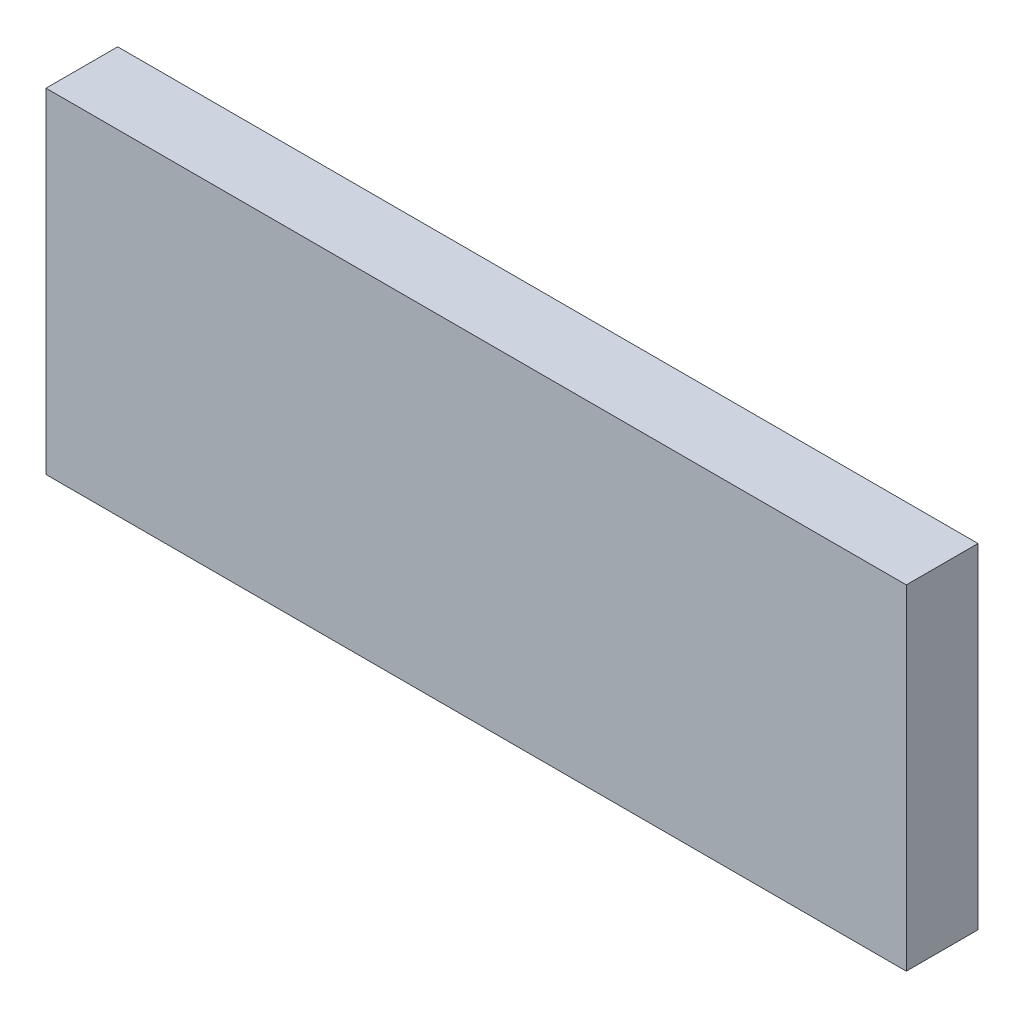
ISO-10303-21;
HEADER;
FILE_DESCRIPTION(('STEP AP214'),'2;1');
FILE_NAME('part.step','',(''),(''),'','','');
FILE_SCHEMA(('AUTOMOTIVE_DESIGN { 1 0 10303 214 1 1 1 1 }'));
ENDSEC;
DATA;
#1=APPLICATION_CONTEXT('core data for automotive mechanical design processes');
#2=APPLICATION_PROTOCOL_DEFINITION('international standard','automotive_design',2000,#1);
#3=PRODUCT_CONTEXT('',#1,'mechanical');
#4=PRODUCT('Part','Part','',(#3));
#5=PRODUCT_RELATED_PRODUCT_CATEGORY('part','',(#4));
#6=PRODUCT_DEFINITION_FORMATION('','',#4);
#7=PRODUCT_DEFINITION_CONTEXT('part definition',#1,'design');
#8=PRODUCT_DEFINITION('design','',#6,#7);
#9=PRODUCT_DEFINITION_SHAPE('','',#8);
#10=(LENGTH_UNIT() NAMED_UNIT(*) SI_UNIT(.MILLI.,.METRE.));
#11=(NAMED_UNIT(*) PLANE_ANGLE_UNIT() SI_UNIT($,.RADIAN.));
#12=(NAMED_UNIT(*) SI_UNIT($,.STERADIAN.) SOLID_ANGLE_UNIT());
#13=UNCERTAINTY_MEASURE_WITH_UNIT(LENGTH_MEASURE(1.E-05),#10,'distance_accuracy_value','');
#14=(GEOMETRIC_REPRESENTATION_CONTEXT(3) GLOBAL_UNCERTAINTY_ASSIGNED_CONTEXT((#13)) GLOBAL_UNIT_ASSIGNED_CONTEXT((#10,
#11,#12)) REPRESENTATION_CONTEXT('',''));
#15=CARTESIAN_POINT('',(0.,0.,0.));
#16=DIRECTION('',(0.,0.,1.));
#17=DIRECTION('',(1.,0.,0.));
#18=AXIS2_PLACEMENT_3D('',#15,#16,#17);
#19=CARTESIAN_POINT('',(0.,0.,0.15));
#20=DIRECTION('',(0.,0.,-1.));
#21=DIRECTION('',(-1.,0.,0.));
#22=AXIS2_PLACEMENT_3D('',#19,#20,#21);
#23=PLANE('',#22);
#24=DIRECTION('',(1.,0.,0.));
#25=VECTOR('',#24,1.);
#26=CARTESIAN_POINT('',(1.95,1.85,0.15));
#27=LINE('',#26,#25);
#28=CARTESIAN_POINT('',(1.95,1.85,0.15));
#29=VERTEX_POINT('',#28);
#30=CARTESIAN_POINT('',(3.75,1.85,0.15));
#31=VERTEX_POINT('',#30);
#32=EDGE_CURVE('E79',#29,#31,#27,.T.);
#33=ORIENTED_EDGE('',*,*,#32,.F.);
#34=DIRECTION('',(0.,1.,0.));
#35=VECTOR('',#34,1.);
#36=CARTESIAN_POINT('',(1.95,1.15,0.15));
#37=LINE('',#36,#35);
#38=CARTESIAN_POINT('',(1.95,1.15,0.15));
#39=VERTEX_POINT('',#38);
#40=EDGE_CURVE('E67',#39,#29,#37,.T.);
#41=ORIENTED_EDGE('',*,*,#40,.F.);
#42=DIRECTION('',(1.,0.,0.));
#43=VECTOR('',#42,1.);
#44=CARTESIAN_POINT('',(3.75,1.15,0.15));
#45=LINE('',#44,#43);
#46=CARTESIAN_POINT('',(3.75,1.15,0.15));
#47=VERTEX_POINT('',#46);
#48=EDGE_CURVE('E54',#47,#39,#45,.F.);
#49=ORIENTED_EDGE('',*,*,#48,.F.);
#50=DIRECTION('',(0.,1.,0.));
#51=VECTOR('',#50,1.);
#52=CARTESIAN_POINT('',(3.75,1.85,0.15));
#53=LINE('',#52,#51);
#54=EDGE_CURVE('E19',#31,#47,#53,.F.);
#55=ORIENTED_EDGE('',*,*,#54,.F.);
#56=EDGE_LOOP('',(#33,#41,#49,#55));
#57=FACE_BOUND('',#56,.T.);
#58=ADVANCED_FACE('F16',(#57),#23,.F.);
#59=CARTESIAN_POINT('',(3.75,1.85,0.15));
#60=DIRECTION('',(1.,0.,0.));
#61=DIRECTION('',(0.,1.,0.));
#62=AXIS2_PLACEMENT_3D('',#59,#60,#61);
#63=PLANE('',#62);
#64=ORIENTED_EDGE('',*,*,#54,.T.);
#65=DIRECTION('',(0.,0.,1.));
#66=VECTOR('',#65,1.);
#67=CARTESIAN_POINT('',(3.75,1.15,0.15));
#68=LINE('',#67,#66);
#69=CARTESIAN_POINT('',(3.75,1.15,0.));
#70=VERTEX_POINT('',#69);
#71=EDGE_CURVE('E60',#70,#47,#68,.T.);
#72=ORIENTED_EDGE('',*,*,#71,.F.);
#73=DIRECTION('',(0.,1.,0.));
#74=VECTOR('',#73,1.);
#75=CARTESIAN_POINT('',(3.75,0.,0.));
#76=LINE('',#75,#74);
#77=CARTESIAN_POINT('',(3.75,1.85,0.));
#78=VERTEX_POINT('',#77);
#79=EDGE_CURVE('E82',#78,#70,#76,.F.);
#80=ORIENTED_EDGE('',*,*,#79,.F.);
#81=DIRECTION('',(0.,0.,1.));
#82=VECTOR('',#81,1.);
#83=CARTESIAN_POINT('',(3.75,1.85,0.15));
#84=LINE('',#83,#82);
#85=EDGE_CURVE('E63',#31,#78,#84,.F.);
#86=ORIENTED_EDGE('',*,*,#85,.F.);
#87=EDGE_LOOP('',(#64,#72,#80,#86));
#88=FACE_BOUND('',#87,.T.);
#89=ADVANCED_FACE('F59',(#88),#63,.T.);
#90=CARTESIAN_POINT('',(3.75,1.15,0.15));
#91=DIRECTION('',(0.,-1.,0.));
#92=DIRECTION('',(1.,0.,0.));
#93=AXIS2_PLACEMENT_3D('',#90,#91,#92);
#94=PLANE('',#93);
#95=ORIENTED_EDGE('',*,*,#48,.T.);
#96=DIRECTION('',(0.,0.,1.));
#97=VECTOR('',#96,1.);
#98=CARTESIAN_POINT('',(1.95,1.15,0.15));
#99=LINE('',#98,#97);
#100=CARTESIAN_POINT('',(1.95,1.15,0.));
#101=VERTEX_POINT('',#100);
#102=EDGE_CURVE('E69',#101,#39,#99,.T.);
#103=ORIENTED_EDGE('',*,*,#102,.F.);
#104=DIRECTION('',(-1.,0.,0.));
#105=VECTOR('',#104,1.);
#106=CARTESIAN_POINT('',(0.,1.15,0.));
#107=LINE('',#106,#105);
#108=EDGE_CURVE('E73',#70,#101,#107,.T.);
#109=ORIENTED_EDGE('',*,*,#108,.F.);
#110=ORIENTED_EDGE('',*,*,#71,.T.);
#111=EDGE_LOOP('',(#95,#103,#109,#110));
#112=FACE_BOUND('',#111,.T.);
#113=ADVANCED_FACE('F71',(#112),#94,.T.);
#114=CARTESIAN_POINT('',(1.95,1.15,0.15));
#115=DIRECTION('',(-1.,0.,0.));
#116=DIRECTION('',(0.,0.,1.));
#117=AXIS2_PLACEMENT_3D('',#114,#115,#116);
#118=PLANE('',#117);
#119=ORIENTED_EDGE('',*,*,#40,.T.);
#120=DIRECTION('',(0.,0.,1.));
#121=VECTOR('',#120,1.);
#122=CARTESIAN_POINT('',(1.95,1.85,0.15));
#123=LINE('',#122,#121);
#124=CARTESIAN_POINT('',(1.95,1.85,0.));
#125=VERTEX_POINT('',#124);
#126=EDGE_CURVE('E34',#125,#29,#123,.T.);
#127=ORIENTED_EDGE('',*,*,#126,.F.);
#128=DIRECTION('',(0.,1.,0.));
#129=VECTOR('',#128,1.);
#130=CARTESIAN_POINT('',(1.95,0.,0.));
#131=LINE('',#130,#129);
#132=EDGE_CURVE('E25',#101,#125,#131,.T.);
#133=ORIENTED_EDGE('',*,*,#132,.F.);
#134=ORIENTED_EDGE('',*,*,#102,.T.);
#135=EDGE_LOOP('',(#119,#127,#133,#134));
#136=FACE_BOUND('',#135,.T.);
#137=ADVANCED_FACE('F88',(#136),#118,.T.);
#138=CARTESIAN_POINT('',(1.95,1.85,0.15));
#139=DIRECTION('',(0.,1.,0.));
#140=DIRECTION('',(0.,0.,1.));
#141=AXIS2_PLACEMENT_3D('',#138,#139,#140);
#142=PLANE('',#141);
#143=ORIENTED_EDGE('',*,*,#32,.T.);
#144=ORIENTED_EDGE('',*,*,#85,.T.);
#145=DIRECTION('',(-1.,0.,0.));
#146=VECTOR('',#145,1.);
#147=CARTESIAN_POINT('',(0.,1.85,0.));
#148=LINE('',#147,#146);
#149=EDGE_CURVE('E11',#125,#78,#148,.F.);
#150=ORIENTED_EDGE('',*,*,#149,.F.);
#151=ORIENTED_EDGE('',*,*,#126,.T.);
#152=EDGE_LOOP('',(#143,#144,#150,#151));
#153=FACE_BOUND('',#152,.T.);
#154=ADVANCED_FACE('F90',(#153),#142,.T.);
#155=CARTESIAN_POINT('',(0.,0.,0.));
#156=DIRECTION('',(0.,0.,-1.));
#157=DIRECTION('',(-1.,0.,0.));
#158=AXIS2_PLACEMENT_3D('',#155,#156,#157);
#159=PLANE('',#158);
#160=ORIENTED_EDGE('',*,*,#132,.T.);
#161=ORIENTED_EDGE('',*,*,#149,.T.);
#162=ORIENTED_EDGE('',*,*,#79,.T.);
#163=ORIENTED_EDGE('',*,*,#108,.T.);
#164=EDGE_LOOP('',(#160,#161,#162,#163));
#165=FACE_BOUND('',#164,.T.);
#166=ADVANCED_FACE('F87',(#165),#159,.T.);
#167=CLOSED_SHELL('',(#58,#89,#113,#137,#154,#166));
#168=MANIFOLD_SOLID_BREP('B1',#167);
#169=ADVANCED_BREP_SHAPE_REPRESENTATION('',(#18,#168),#14);
#170=SHAPE_DEFINITION_REPRESENTATION(#9,#169);
ENDSEC;
END-ISO-10303-21;
